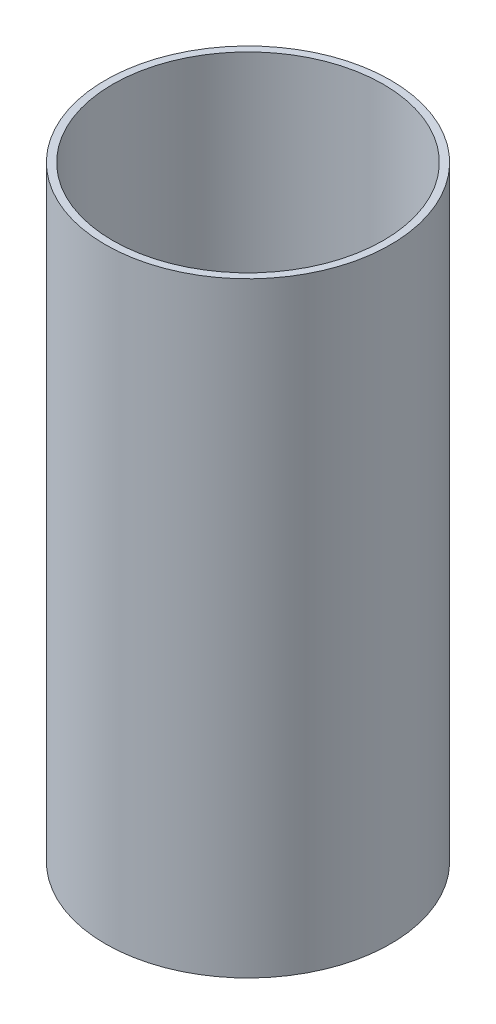
ISO-10303-21;
HEADER;
FILE_DESCRIPTION(('STEP AP214'),'2;1');
FILE_NAME('part.step','',(''),(''),'','','');
FILE_SCHEMA(('AUTOMOTIVE_DESIGN { 1 0 10303 214 1 1 1 1 }'));
ENDSEC;
DATA;
#1=APPLICATION_CONTEXT('core data for automotive mechanical design processes');
#2=APPLICATION_PROTOCOL_DEFINITION('international standard','automotive_design',2000,#1);
#3=PRODUCT_CONTEXT('',#1,'mechanical');
#4=PRODUCT('Part','Part','',(#3));
#5=PRODUCT_RELATED_PRODUCT_CATEGORY('part','',(#4));
#6=PRODUCT_DEFINITION_FORMATION('','',#4);
#7=PRODUCT_DEFINITION_CONTEXT('part definition',#1,'design');
#8=PRODUCT_DEFINITION('design','',#6,#7);
#9=PRODUCT_DEFINITION_SHAPE('','',#8);
#10=(LENGTH_UNIT() NAMED_UNIT(*) SI_UNIT(.MILLI.,.METRE.));
#11=(NAMED_UNIT(*) PLANE_ANGLE_UNIT() SI_UNIT($,.RADIAN.));
#12=(NAMED_UNIT(*) SI_UNIT($,.STERADIAN.) SOLID_ANGLE_UNIT());
#13=UNCERTAINTY_MEASURE_WITH_UNIT(LENGTH_MEASURE(1.E-05),#10,'distance_accuracy_value','');
#14=(GEOMETRIC_REPRESENTATION_CONTEXT(3) GLOBAL_UNCERTAINTY_ASSIGNED_CONTEXT((#13)) GLOBAL_UNIT_ASSIGNED_CONTEXT((#10,
#11,#12)) REPRESENTATION_CONTEXT('',''));
#15=CARTESIAN_POINT('',(0.,0.,0.));
#16=DIRECTION('',(0.,0.,1.));
#17=DIRECTION('',(1.,0.,0.));
#18=AXIS2_PLACEMENT_3D('',#15,#16,#17);
#19=CARTESIAN_POINT('',(0.,198.882,0.));
#20=DIRECTION('',(0.,1.,0.));
#21=DIRECTION('',(0.,0.,1.));
#22=AXIS2_PLACEMENT_3D('',#19,#20,#21);
#23=PLANE('',#22);
#24=CARTESIAN_POINT('',(0.,198.882,0.));
#25=DIRECTION('',(0.,1.,0.));
#26=DIRECTION('',(0.,0.,1.));
#27=AXIS2_PLACEMENT_3D('',#24,#25,#26);
#28=CIRCLE('',#27,93.6625);
#29=CARTESIAN_POINT('',(0.,198.882,93.6625));
#30=VERTEX_POINT('',#29);
#31=EDGE_CURVE('E10',#30,#30,#28,.T.);
#32=ORIENTED_EDGE('',*,*,#31,.T.);
#33=EDGE_LOOP('',(#32));
#34=FACE_BOUND('',#33,.T.);
#35=CARTESIAN_POINT('',(0.,198.882,0.));
#36=DIRECTION('',(0.,1.,0.));
#37=DIRECTION('',(0.,0.,1.));
#38=AXIS2_PLACEMENT_3D('',#35,#36,#37);
#39=CIRCLE('',#38,88.9);
#40=CARTESIAN_POINT('',(0.,198.882,88.9));
#41=VERTEX_POINT('',#40);
#42=EDGE_CURVE('E46',#41,#41,#39,.T.);
#43=ORIENTED_EDGE('',*,*,#42,.F.);
#44=EDGE_LOOP('',(#43));
#45=FACE_BOUND('',#44,.T.);
#46=ADVANCED_FACE('F35',(#34,#45),#23,.T.);
#47=CARTESIAN_POINT('',(0.,-198.882,0.));
#48=DIRECTION('',(0.,1.,0.));
#49=DIRECTION('',(0.,0.,1.));
#50=AXIS2_PLACEMENT_3D('',#47,#48,#49);
#51=PLANE('',#50);
#52=CARTESIAN_POINT('',(0.,-198.882,0.));
#53=DIRECTION('',(0.,1.,0.));
#54=DIRECTION('',(0.,0.,1.));
#55=AXIS2_PLACEMENT_3D('',#52,#53,#54);
#56=CIRCLE('',#55,93.6625);
#57=CARTESIAN_POINT('',(0.,-198.882,93.6625));
#58=VERTEX_POINT('',#57);
#59=EDGE_CURVE('E39',#58,#58,#56,.T.);
#60=ORIENTED_EDGE('',*,*,#59,.F.);
#61=EDGE_LOOP('',(#60));
#62=FACE_BOUND('',#61,.T.);
#63=CARTESIAN_POINT('',(0.,-198.882,0.));
#64=DIRECTION('',(0.,1.,0.));
#65=DIRECTION('',(0.,0.,1.));
#66=AXIS2_PLACEMENT_3D('',#63,#64,#65);
#67=CIRCLE('',#66,88.9);
#68=CARTESIAN_POINT('',(0.,-198.882,88.9));
#69=VERTEX_POINT('',#68);
#70=EDGE_CURVE('E48',#69,#69,#67,.T.);
#71=ORIENTED_EDGE('',*,*,#70,.T.);
#72=EDGE_LOOP('',(#71));
#73=FACE_BOUND('',#72,.T.);
#74=ADVANCED_FACE('F58',(#62,#73),#51,.F.);
#75=CARTESIAN_POINT('',(0.,198.882,0.));
#76=DIRECTION('',(0.,-1.,0.));
#77=DIRECTION('',(0.,0.,-1.));
#78=AXIS2_PLACEMENT_3D('',#75,#76,#77);
#79=CYLINDRICAL_SURFACE('',#78,93.6625);
#80=ORIENTED_EDGE('',*,*,#31,.F.);
#81=EDGE_LOOP('',(#80));
#82=FACE_BOUND('',#81,.T.);
#83=ORIENTED_EDGE('',*,*,#59,.T.);
#84=EDGE_LOOP('',(#83));
#85=FACE_BOUND('',#84,.T.);
#86=ADVANCED_FACE('F37',(#82,#85),#79,.T.);
#87=CARTESIAN_POINT('',(0.,198.882,0.));
#88=DIRECTION('',(0.,-1.,0.));
#89=DIRECTION('',(0.,0.,-1.));
#90=AXIS2_PLACEMENT_3D('',#87,#88,#89);
#91=CYLINDRICAL_SURFACE('',#90,88.9);
#92=ORIENTED_EDGE('',*,*,#42,.T.);
#93=EDGE_LOOP('',(#92));
#94=FACE_BOUND('',#93,.T.);
#95=ORIENTED_EDGE('',*,*,#70,.F.);
#96=EDGE_LOOP('',(#95));
#97=FACE_BOUND('',#96,.T.);
#98=ADVANCED_FACE('F54',(#94,#97),#91,.F.);
#99=CLOSED_SHELL('',(#46,#74,#86,#98));
#100=MANIFOLD_SOLID_BREP('B2',#99);
#101=ADVANCED_BREP_SHAPE_REPRESENTATION('',(#18,#100),#14);
#102=SHAPE_DEFINITION_REPRESENTATION(#9,#101);
ENDSEC;
END-ISO-10303-21;
